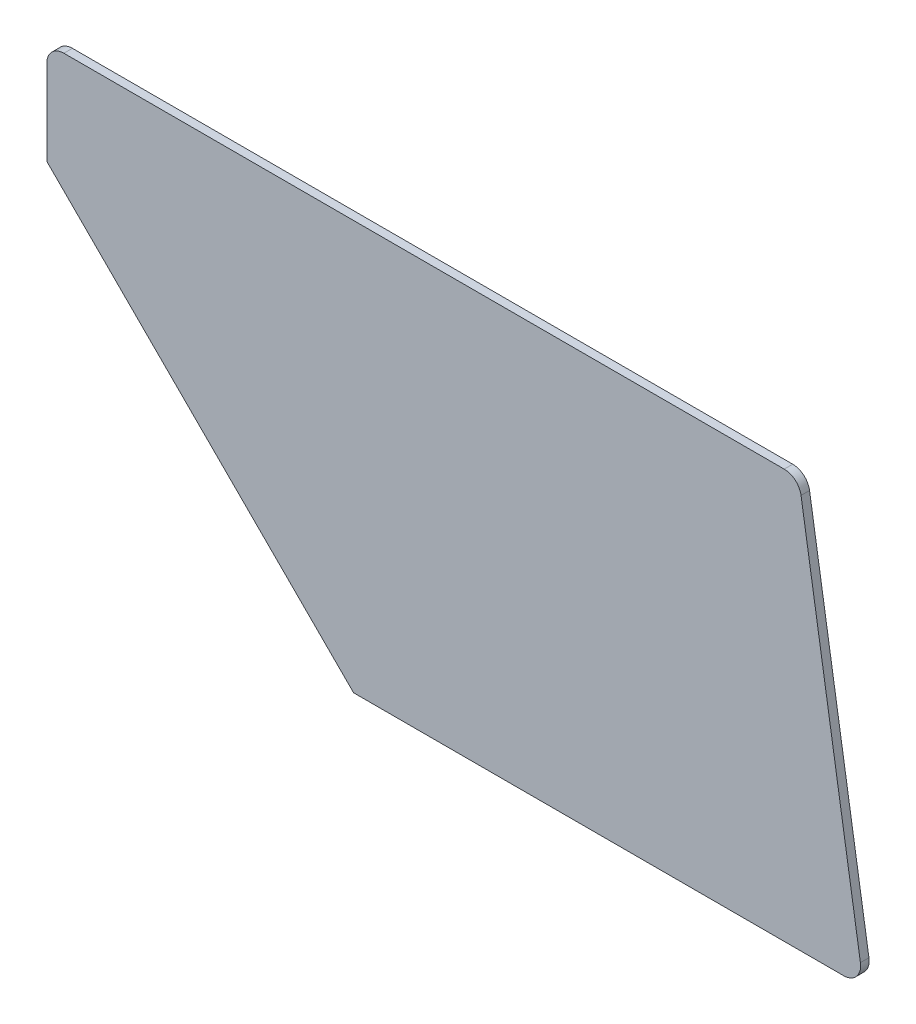
ISO-10303-21;
HEADER;
FILE_DESCRIPTION(('STEP AP214'),'2;1');
FILE_NAME('part.step','',(''),(''),'','','');
FILE_SCHEMA(('AUTOMOTIVE_DESIGN { 1 0 10303 214 1 1 1 1 }'));
ENDSEC;
DATA;
#1=APPLICATION_CONTEXT('core data for automotive mechanical design processes');
#2=APPLICATION_PROTOCOL_DEFINITION('international standard','automotive_design',2000,#1);
#3=PRODUCT_CONTEXT('',#1,'mechanical');
#4=PRODUCT('Part','Part','',(#3));
#5=PRODUCT_RELATED_PRODUCT_CATEGORY('part','',(#4));
#6=PRODUCT_DEFINITION_FORMATION('','',#4);
#7=PRODUCT_DEFINITION_CONTEXT('part definition',#1,'design');
#8=PRODUCT_DEFINITION('design','',#6,#7);
#9=PRODUCT_DEFINITION_SHAPE('','',#8);
#10=(LENGTH_UNIT() NAMED_UNIT(*) SI_UNIT(.MILLI.,.METRE.));
#11=(NAMED_UNIT(*) PLANE_ANGLE_UNIT() SI_UNIT($,.RADIAN.));
#12=(NAMED_UNIT(*) SI_UNIT($,.STERADIAN.) SOLID_ANGLE_UNIT());
#13=UNCERTAINTY_MEASURE_WITH_UNIT(LENGTH_MEASURE(1.E-05),#10,'distance_accuracy_value','');
#14=(GEOMETRIC_REPRESENTATION_CONTEXT(3) GLOBAL_UNCERTAINTY_ASSIGNED_CONTEXT((#13)) GLOBAL_UNIT_ASSIGNED_CONTEXT((#10,
#11,#12)) REPRESENTATION_CONTEXT('',''));
#15=CARTESIAN_POINT('',(0.,0.,0.));
#16=DIRECTION('',(0.,0.,1.));
#17=DIRECTION('',(1.,0.,0.));
#18=AXIS2_PLACEMENT_3D('',#15,#16,#17);
#19=CARTESIAN_POINT('',(0.,-38.1,3.175));
#20=DIRECTION('',(0.707106781186549,0.707106781186546,0.));
#21=DIRECTION('',(-0.707106781186546,0.707106781186549,0.));
#22=AXIS2_PLACEMENT_3D('',#19,#20,#21);
#23=PLANE('',#22);
#24=DIRECTION('',(0.707106781186546,-0.707106781186549,0.));
#25=VECTOR('',#24,1.);
#26=CARTESIAN_POINT('',(0.,-38.1,0.));
#27=LINE('',#26,#25);
#28=CARTESIAN_POINT('',(0.,-38.1,0.));
#29=VERTEX_POINT('',#28);
#30=CARTESIAN_POINT('',(114.3,-152.4,0.));
#31=VERTEX_POINT('',#30);
#32=EDGE_CURVE('E133',#29,#31,#27,.T.);
#33=ORIENTED_EDGE('',*,*,#32,.T.);
#34=DIRECTION('',(0.,0.,-1.));
#35=VECTOR('',#34,1.);
#36=CARTESIAN_POINT('',(114.3,-152.4,3.175));
#37=LINE('',#36,#35);
#38=CARTESIAN_POINT('',(114.3,-152.4,3.175));
#39=VERTEX_POINT('',#38);
#40=EDGE_CURVE('E11',#39,#31,#37,.T.);
#41=ORIENTED_EDGE('',*,*,#40,.F.);
#42=DIRECTION('',(0.707106781186546,-0.707106781186549,0.));
#43=VECTOR('',#42,1.);
#44=CARTESIAN_POINT('',(0.,-38.1,3.175));
#45=LINE('',#44,#43);
#46=CARTESIAN_POINT('',(0.,-38.1,3.175));
#47=VERTEX_POINT('',#46);
#48=EDGE_CURVE('E147',#47,#39,#45,.T.);
#49=ORIENTED_EDGE('',*,*,#48,.F.);
#50=DIRECTION('',(0.,0.,-1.));
#51=VECTOR('',#50,1.);
#52=CARTESIAN_POINT('',(0.,-38.1,3.175));
#53=LINE('',#52,#51);
#54=EDGE_CURVE('E129',#47,#29,#53,.T.);
#55=ORIENTED_EDGE('',*,*,#54,.T.);
#56=EDGE_LOOP('',(#33,#41,#49,#55));
#57=FACE_BOUND('',#56,.T.);
#58=ADVANCED_FACE('F37',(#57),#23,.F.);
#59=CARTESIAN_POINT('',(114.3,-152.4,3.175));
#60=DIRECTION('',(0.,1.,0.));
#61=DIRECTION('',(-1.,0.,0.));
#62=AXIS2_PLACEMENT_3D('',#59,#60,#61);
#63=PLANE('',#62);
#64=DIRECTION('',(1.,0.,0.));
#65=VECTOR('',#64,1.);
#66=CARTESIAN_POINT('',(114.3,-152.4,0.));
#67=LINE('',#66,#65);
#68=CARTESIAN_POINT('',(296.8625,-152.4,0.));
#69=VERTEX_POINT('',#68);
#70=EDGE_CURVE('E136',#31,#69,#67,.T.);
#71=ORIENTED_EDGE('',*,*,#70,.T.);
#72=DIRECTION('',(0.,0.,-1.));
#73=VECTOR('',#72,1.);
#74=CARTESIAN_POINT('',(296.8625,-152.4,3.175));
#75=LINE('',#74,#73);
#76=CARTESIAN_POINT('',(296.8625,-152.4,3.175));
#77=VERTEX_POINT('',#76);
#78=EDGE_CURVE('E45',#77,#69,#75,.T.);
#79=ORIENTED_EDGE('',*,*,#78,.F.);
#80=DIRECTION('',(1.,0.,0.));
#81=VECTOR('',#80,1.);
#82=CARTESIAN_POINT('',(114.3,-152.4,3.175));
#83=LINE('',#82,#81);
#84=EDGE_CURVE('E96',#39,#77,#83,.T.);
#85=ORIENTED_EDGE('',*,*,#84,.F.);
#86=ORIENTED_EDGE('',*,*,#40,.T.);
#87=EDGE_LOOP('',(#71,#79,#85,#86));
#88=FACE_BOUND('',#87,.T.);
#89=ADVANCED_FACE('F182',(#88),#63,.F.);
#90=CARTESIAN_POINT('',(296.8625,-146.05,3.175));
#91=DIRECTION('',(0.,0.,-1.));
#92=DIRECTION('',(-1.,0.,0.));
#93=AXIS2_PLACEMENT_3D('',#90,#91,#92);
#94=CYLINDRICAL_SURFACE('',#93,6.34999999999993);
#95=CARTESIAN_POINT('',(296.8625,-146.05,0.));
#96=DIRECTION('',(0.,0.,1.));
#97=DIRECTION('',(1.,0.,0.));
#98=AXIS2_PLACEMENT_3D('',#95,#96,#97);
#99=CIRCLE('',#98,6.34999999999993);
#100=CARTESIAN_POINT('',(303.134320962779,-145.056641146995,0.));
#101=VERTEX_POINT('',#100);
#102=EDGE_CURVE('E138',#69,#101,#99,.T.);
#103=ORIENTED_EDGE('',*,*,#102,.T.);
#104=DIRECTION('',(0.,0.,-1.));
#105=VECTOR('',#104,1.);
#106=CARTESIAN_POINT('',(303.134320962779,-145.056641146995,3.175));
#107=LINE('',#106,#105);
#108=CARTESIAN_POINT('',(303.134320962779,-145.056641146995,3.175));
#109=VERTEX_POINT('',#108);
#110=EDGE_CURVE('E154',#109,#101,#107,.T.);
#111=ORIENTED_EDGE('',*,*,#110,.F.);
#112=CARTESIAN_POINT('',(296.8625,-146.05,3.175));
#113=DIRECTION('',(0.,0.,1.));
#114=DIRECTION('',(1.,0.,0.));
#115=AXIS2_PLACEMENT_3D('',#112,#113,#114);
#116=CIRCLE('',#115,6.34999999999993);
#117=EDGE_CURVE('E162',#77,#109,#116,.T.);
#118=ORIENTED_EDGE('',*,*,#117,.F.);
#119=ORIENTED_EDGE('',*,*,#78,.T.);
#120=EDGE_LOOP('',(#103,#111,#118,#119));
#121=FACE_BOUND('',#120,.T.);
#122=ADVANCED_FACE('F160',(#121),#94,.T.);
#123=CARTESIAN_POINT('',(303.134320962779,-145.056641146995,3.175));
#124=DIRECTION('',(-0.987688340595137,-0.156434465040235,0.));
#125=DIRECTION('',(0.156434465040235,-0.987688340595137,0.));
#126=AXIS2_PLACEMENT_3D('',#123,#124,#125);
#127=PLANE('',#126);
#128=DIRECTION('',(-0.156434465040235,0.987688340595137,0.));
#129=VECTOR('',#128,1.);
#130=CARTESIAN_POINT('',(303.134320962779,-145.056641146995,0.));
#131=LINE('',#130,#129);
#132=CARTESIAN_POINT('',(281.008014649441,-5.35664114699449,0.));
#133=VERTEX_POINT('',#132);
#134=EDGE_CURVE('E140',#101,#133,#131,.T.);
#135=ORIENTED_EDGE('',*,*,#134,.T.);
#136=DIRECTION('',(0.,0.,-1.));
#137=VECTOR('',#136,1.);
#138=CARTESIAN_POINT('',(281.008014649441,-5.35664114699449,3.175));
#139=LINE('',#138,#137);
#140=CARTESIAN_POINT('',(281.008014649441,-5.35664114699449,3.175));
#141=VERTEX_POINT('',#140);
#142=EDGE_CURVE('E151',#141,#133,#139,.T.);
#143=ORIENTED_EDGE('',*,*,#142,.F.);
#144=DIRECTION('',(-0.156434465040235,0.987688340595137,0.));
#145=VECTOR('',#144,1.);
#146=CARTESIAN_POINT('',(303.134320962779,-145.056641146995,3.175));
#147=LINE('',#146,#145);
#148=EDGE_CURVE('E174',#109,#141,#147,.T.);
#149=ORIENTED_EDGE('',*,*,#148,.F.);
#150=ORIENTED_EDGE('',*,*,#110,.T.);
#151=EDGE_LOOP('',(#135,#143,#149,#150));
#152=FACE_BOUND('',#151,.T.);
#153=ADVANCED_FACE('F170',(#152),#127,.F.);
#154=CARTESIAN_POINT('',(274.736193686662,-6.34999999999997,3.175));
#155=DIRECTION('',(0.,0.,-1.));
#156=DIRECTION('',(-1.,0.,0.));
#157=AXIS2_PLACEMENT_3D('',#154,#155,#156);
#158=CYLINDRICAL_SURFACE('',#157,6.34999999999993);
#159=CARTESIAN_POINT('',(274.736193686662,-6.34999999999997,0.));
#160=DIRECTION('',(0.,0.,1.));
#161=DIRECTION('',(-1.,0.,0.));
#162=AXIS2_PLACEMENT_3D('',#159,#160,#161);
#163=CIRCLE('',#162,6.34999999999993);
#164=CARTESIAN_POINT('',(274.736193686662,0.,0.));
#165=VERTEX_POINT('',#164);
#166=EDGE_CURVE('E142',#133,#165,#163,.T.);
#167=ORIENTED_EDGE('',*,*,#166,.T.);
#168=DIRECTION('',(0.,0.,-1.));
#169=VECTOR('',#168,1.);
#170=CARTESIAN_POINT('',(274.736193686662,0.,3.175));
#171=LINE('',#170,#169);
#172=CARTESIAN_POINT('',(274.736193686662,0.,3.175));
#173=VERTEX_POINT('',#172);
#174=EDGE_CURVE('E124',#173,#165,#171,.T.);
#175=ORIENTED_EDGE('',*,*,#174,.F.);
#176=CARTESIAN_POINT('',(274.736193686662,-6.34999999999997,3.175));
#177=DIRECTION('',(0.,0.,1.));
#178=DIRECTION('',(-1.,0.,0.));
#179=AXIS2_PLACEMENT_3D('',#176,#177,#178);
#180=CIRCLE('',#179,6.34999999999993);
#181=EDGE_CURVE('E115',#141,#173,#180,.T.);
#182=ORIENTED_EDGE('',*,*,#181,.F.);
#183=ORIENTED_EDGE('',*,*,#142,.T.);
#184=EDGE_LOOP('',(#167,#175,#182,#183));
#185=FACE_BOUND('',#184,.T.);
#186=ADVANCED_FACE('F173',(#185),#158,.T.);
#187=CARTESIAN_POINT('',(274.736193686662,0.,3.175));
#188=DIRECTION('',(0.,-1.,0.));
#189=DIRECTION('',(1.,0.,0.));
#190=AXIS2_PLACEMENT_3D('',#187,#188,#189);
#191=PLANE('',#190);
#192=DIRECTION('',(-1.,0.,0.));
#193=VECTOR('',#192,1.);
#194=CARTESIAN_POINT('',(274.736193686662,0.,0.));
#195=LINE('',#194,#193);
#196=CARTESIAN_POINT('',(6.35000000000004,0.,0.));
#197=VERTEX_POINT('',#196);
#198=EDGE_CURVE('E123',#165,#197,#195,.T.);
#199=ORIENTED_EDGE('',*,*,#198,.T.);
#200=DIRECTION('',(0.,0.,-1.));
#201=VECTOR('',#200,1.);
#202=CARTESIAN_POINT('',(6.35000000000004,0.,3.175));
#203=LINE('',#202,#201);
#204=CARTESIAN_POINT('',(6.35000000000004,0.,3.175));
#205=VERTEX_POINT('',#204);
#206=EDGE_CURVE('E120',#205,#197,#203,.T.);
#207=ORIENTED_EDGE('',*,*,#206,.F.);
#208=DIRECTION('',(-1.,0.,0.));
#209=VECTOR('',#208,1.);
#210=CARTESIAN_POINT('',(274.736193686662,0.,3.175));
#211=LINE('',#210,#209);
#212=EDGE_CURVE('E109',#173,#205,#211,.T.);
#213=ORIENTED_EDGE('',*,*,#212,.F.);
#214=ORIENTED_EDGE('',*,*,#174,.T.);
#215=EDGE_LOOP('',(#199,#207,#213,#214));
#216=FACE_BOUND('',#215,.T.);
#217=ADVANCED_FACE('F121',(#216),#191,.F.);
#218=CARTESIAN_POINT('',(6.35,-6.35,3.175));
#219=DIRECTION('',(0.,0.,-1.));
#220=DIRECTION('',(-1.,0.,0.));
#221=AXIS2_PLACEMENT_3D('',#218,#219,#220);
#222=CYLINDRICAL_SURFACE('',#221,6.35);
#223=CARTESIAN_POINT('',(6.35,-6.35,0.));
#224=DIRECTION('',(0.,0.,1.));
#225=DIRECTION('',(1.,0.,0.));
#226=AXIS2_PLACEMENT_3D('',#223,#224,#225);
#227=CIRCLE('',#226,6.35);
#228=CARTESIAN_POINT('',(0.,-6.35000000000004,0.));
#229=VERTEX_POINT('',#228);
#230=EDGE_CURVE('E82',#197,#229,#227,.T.);
#231=ORIENTED_EDGE('',*,*,#230,.T.);
#232=DIRECTION('',(0.,0.,-1.));
#233=VECTOR('',#232,1.);
#234=CARTESIAN_POINT('',(0.,-6.35000000000004,3.175));
#235=LINE('',#234,#233);
#236=CARTESIAN_POINT('',(0.,-6.35000000000004,3.175));
#237=VERTEX_POINT('',#236);
#238=EDGE_CURVE('E125',#237,#229,#235,.T.);
#239=ORIENTED_EDGE('',*,*,#238,.F.);
#240=CARTESIAN_POINT('',(6.35,-6.35,3.175));
#241=DIRECTION('',(0.,0.,1.));
#242=DIRECTION('',(1.,0.,0.));
#243=AXIS2_PLACEMENT_3D('',#240,#241,#242);
#244=CIRCLE('',#243,6.35);
#245=EDGE_CURVE('E113',#205,#237,#244,.T.);
#246=ORIENTED_EDGE('',*,*,#245,.F.);
#247=ORIENTED_EDGE('',*,*,#206,.T.);
#248=EDGE_LOOP('',(#231,#239,#246,#247));
#249=FACE_BOUND('',#248,.T.);
#250=ADVANCED_FACE('F127',(#249),#222,.T.);
#251=CARTESIAN_POINT('',(0.,-6.35000000000004,3.175));
#252=DIRECTION('',(1.,0.,0.));
#253=DIRECTION('',(0.,0.,-1.));
#254=AXIS2_PLACEMENT_3D('',#251,#252,#253);
#255=PLANE('',#254);
#256=DIRECTION('',(0.,-1.,0.));
#257=VECTOR('',#256,1.);
#258=CARTESIAN_POINT('',(0.,-6.35000000000004,0.));
#259=LINE('',#258,#257);
#260=EDGE_CURVE('E88',#229,#29,#259,.T.);
#261=ORIENTED_EDGE('',*,*,#260,.T.);
#262=ORIENTED_EDGE('',*,*,#54,.F.);
#263=DIRECTION('',(0.,-1.,0.));
#264=VECTOR('',#263,1.);
#265=CARTESIAN_POINT('',(0.,-6.35000000000004,3.175));
#266=LINE('',#265,#264);
#267=EDGE_CURVE('E53',#237,#47,#266,.T.);
#268=ORIENTED_EDGE('',*,*,#267,.F.);
#269=ORIENTED_EDGE('',*,*,#238,.T.);
#270=EDGE_LOOP('',(#261,#262,#268,#269));
#271=FACE_BOUND('',#270,.T.);
#272=ADVANCED_FACE('F198',(#271),#255,.F.);
#273=CARTESIAN_POINT('',(296.8625,-146.05,3.175));
#274=DIRECTION('',(0.,0.,1.));
#275=DIRECTION('',(1.,0.,0.));
#276=AXIS2_PLACEMENT_3D('',#273,#274,#275);
#277=PLANE('',#276);
#278=ORIENTED_EDGE('',*,*,#48,.T.);
#279=ORIENTED_EDGE('',*,*,#84,.T.);
#280=ORIENTED_EDGE('',*,*,#117,.T.);
#281=ORIENTED_EDGE('',*,*,#148,.T.);
#282=ORIENTED_EDGE('',*,*,#181,.T.);
#283=ORIENTED_EDGE('',*,*,#212,.T.);
#284=ORIENTED_EDGE('',*,*,#245,.T.);
#285=ORIENTED_EDGE('',*,*,#267,.T.);
#286=EDGE_LOOP('',(#278,#279,#280,#281,#282,#283,#284,#285));
#287=FACE_BOUND('',#286,.T.);
#288=ADVANCED_FACE('F111',(#287),#277,.T.);
#289=CARTESIAN_POINT('',(296.8625,-146.05,0.));
#290=DIRECTION('',(0.,0.,1.));
#291=DIRECTION('',(1.,0.,0.));
#292=AXIS2_PLACEMENT_3D('',#289,#290,#291);
#293=PLANE('',#292);
#294=ORIENTED_EDGE('',*,*,#32,.F.);
#295=ORIENTED_EDGE('',*,*,#260,.F.);
#296=ORIENTED_EDGE('',*,*,#230,.F.);
#297=ORIENTED_EDGE('',*,*,#198,.F.);
#298=ORIENTED_EDGE('',*,*,#166,.F.);
#299=ORIENTED_EDGE('',*,*,#134,.F.);
#300=ORIENTED_EDGE('',*,*,#102,.F.);
#301=ORIENTED_EDGE('',*,*,#70,.F.);
#302=EDGE_LOOP('',(#294,#295,#296,#297,#298,#299,#300,#301));
#303=FACE_BOUND('',#302,.T.);
#304=ADVANCED_FACE('F166',(#303),#293,.F.);
#305=CLOSED_SHELL('',(#58,#89,#122,#153,#186,#217,#250,#272,#288,#304));
#306=MANIFOLD_SOLID_BREP('B2',#305);
#307=ADVANCED_BREP_SHAPE_REPRESENTATION('',(#18,#306),#14);
#308=SHAPE_DEFINITION_REPRESENTATION(#9,#307);
ENDSEC;
END-ISO-10303-21;
